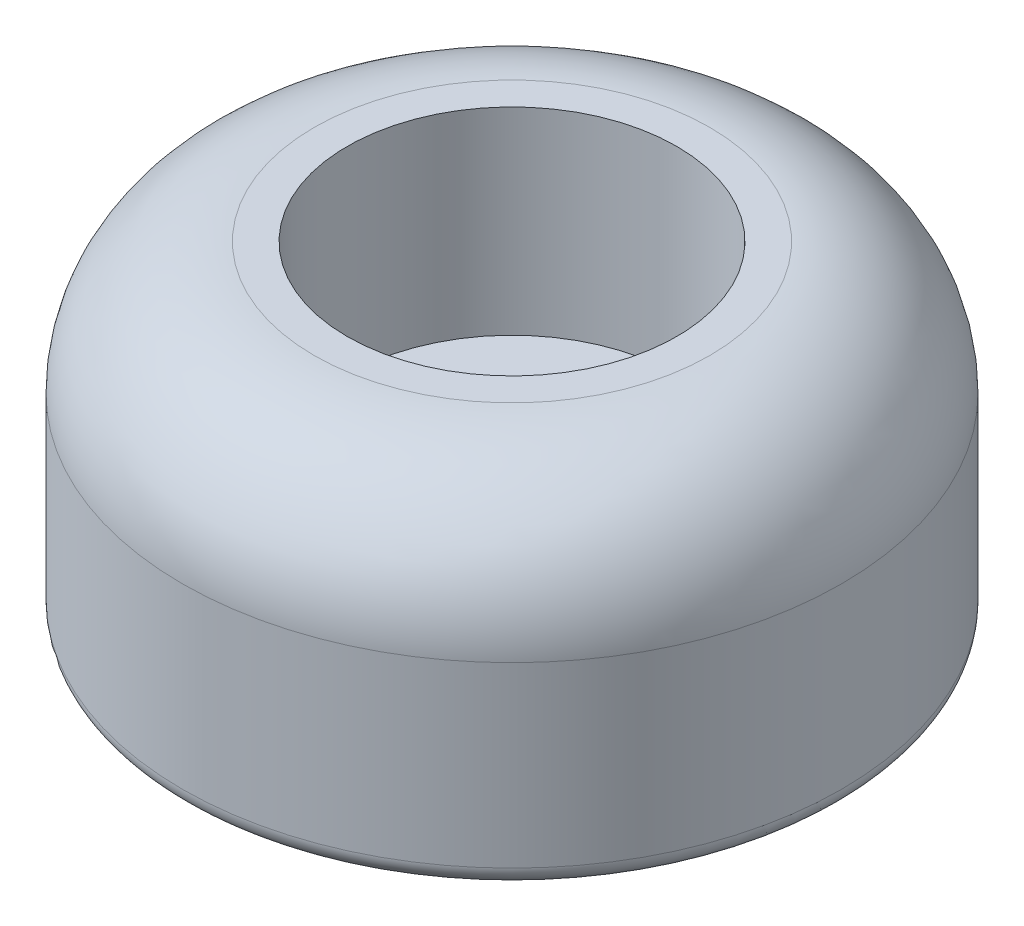
ISO-10303-21;
HEADER;
FILE_DESCRIPTION(('STEP AP214'),'2;1');
FILE_NAME('part.step','',(''),(''),'','','');
FILE_SCHEMA(('AUTOMOTIVE_DESIGN { 1 0 10303 214 1 1 1 1 }'));
ENDSEC;
DATA;
#1=APPLICATION_CONTEXT('core data for automotive mechanical design processes');
#2=APPLICATION_PROTOCOL_DEFINITION('international standard','automotive_design',2000,#1);
#3=PRODUCT_CONTEXT('',#1,'mechanical');
#4=PRODUCT('Part','Part','',(#3));
#5=PRODUCT_RELATED_PRODUCT_CATEGORY('part','',(#4));
#6=PRODUCT_DEFINITION_FORMATION('','',#4);
#7=PRODUCT_DEFINITION_CONTEXT('part definition',#1,'design');
#8=PRODUCT_DEFINITION('design','',#6,#7);
#9=PRODUCT_DEFINITION_SHAPE('','',#8);
#10=(LENGTH_UNIT() NAMED_UNIT(*) SI_UNIT(.MILLI.,.METRE.));
#11=(NAMED_UNIT(*) PLANE_ANGLE_UNIT() SI_UNIT($,.RADIAN.));
#12=(NAMED_UNIT(*) SI_UNIT($,.STERADIAN.) SOLID_ANGLE_UNIT());
#13=UNCERTAINTY_MEASURE_WITH_UNIT(LENGTH_MEASURE(1.E-05),#10,'distance_accuracy_value','');
#14=(GEOMETRIC_REPRESENTATION_CONTEXT(3) GLOBAL_UNCERTAINTY_ASSIGNED_CONTEXT((#13)) GLOBAL_UNIT_ASSIGNED_CONTEXT((#10,
#11,#12)) REPRESENTATION_CONTEXT('',''));
#15=CARTESIAN_POINT('',(0.,0.,0.));
#16=DIRECTION('',(0.,0.,1.));
#17=DIRECTION('',(1.,0.,0.));
#18=AXIS2_PLACEMENT_3D('',#15,#16,#17);
#19=CARTESIAN_POINT('',(2.5,2.,0.));
#20=DIRECTION('',(0.,-1.,0.));
#21=DIRECTION('',(0.,0.,-1.));
#22=AXIS2_PLACEMENT_3D('',#19,#20,#21);
#23=PLANE('',#22);
#24=CARTESIAN_POINT('',(0.,2.,0.));
#25=DIRECTION('',(0.,1.,0.));
#26=DIRECTION('',(0.,0.,1.));
#27=AXIS2_PLACEMENT_3D('',#24,#25,#26);
#28=CIRCLE('',#27,2.5);
#29=CARTESIAN_POINT('',(0.,2.,2.5));
#30=VERTEX_POINT('',#29);
#31=EDGE_CURVE('P0_E66',#30,#30,#28,.T.);
#32=ORIENTED_EDGE('',*,*,#31,.T.);
#33=EDGE_LOOP('',(#32));
#34=FACE_BOUND('',#33,.T.);
#35=CARTESIAN_POINT('',(0.,2.,0.));
#36=DIRECTION('',(0.,1.,0.));
#37=DIRECTION('',(0.,0.,1.));
#38=AXIS2_PLACEMENT_3D('',#35,#36,#37);
#39=CIRCLE('',#38,3.5);
#40=CARTESIAN_POINT('',(0.,2.,3.5));
#41=VERTEX_POINT('',#40);
#42=EDGE_CURVE('P0_E63',#41,#41,#39,.F.);
#43=ORIENTED_EDGE('',*,*,#42,.T.);
#44=EDGE_LOOP('',(#43));
#45=FACE_BOUND('',#44,.T.);
#46=ADVANCED_FACE('P0_F43',(#34,#45),#23,.T.);
#47=CARTESIAN_POINT('',(0.,0.,0.));
#48=DIRECTION('',(0.,1.,0.));
#49=DIRECTION('',(0.,0.,1.));
#50=AXIS2_PLACEMENT_3D('',#47,#48,#49);
#51=CYLINDRICAL_SURFACE('',#50,3.5);
#52=ORIENTED_EDGE('',*,*,#42,.F.);
#53=EDGE_LOOP('',(#52));
#54=FACE_BOUND('',#53,.T.);
#55=CARTESIAN_POINT('',(0.,1.5,0.));
#56=DIRECTION('',(0.,1.,0.));
#57=DIRECTION('',(0.,0.,1.));
#58=AXIS2_PLACEMENT_3D('',#55,#56,#57);
#59=CIRCLE('',#58,3.5);
#60=CARTESIAN_POINT('',(0.,1.5,3.5));
#61=VERTEX_POINT('',#60);
#62=EDGE_CURVE('P0_E71',#61,#61,#59,.T.);
#63=ORIENTED_EDGE('',*,*,#62,.F.);
#64=EDGE_LOOP('',(#63));
#65=FACE_BOUND('',#64,.T.);
#66=ADVANCED_FACE('P0_F137',(#54,#65),#51,.F.);
#67=CARTESIAN_POINT('',(0.,0.,0.));
#68=DIRECTION('',(0.,1.,0.));
#69=DIRECTION('',(0.,0.,1.));
#70=AXIS2_PLACEMENT_3D('',#67,#68,#69);
#71=CYLINDRICAL_SURFACE('',#70,2.5);
#72=CARTESIAN_POINT('',(0.,5.,0.));
#73=DIRECTION('',(0.,1.,0.));
#74=DIRECTION('',(0.,0.,1.));
#75=AXIS2_PLACEMENT_3D('',#72,#73,#74);
#76=CIRCLE('',#75,2.5);
#77=CARTESIAN_POINT('',(0.,5.,2.5));
#78=VERTEX_POINT('',#77);
#79=EDGE_CURVE('P0_E76',#78,#78,#76,.F.);
#80=ORIENTED_EDGE('',*,*,#79,.F.);
#81=EDGE_LOOP('',(#80));
#82=FACE_BOUND('',#81,.T.);
#83=ORIENTED_EDGE('',*,*,#31,.F.);
#84=EDGE_LOOP('',(#83));
#85=FACE_BOUND('',#84,.T.);
#86=ADVANCED_FACE('P0_F133',(#82,#85),#71,.F.);
#87=CARTESIAN_POINT('',(3.5,1.5,0.));
#88=DIRECTION('',(0.,1.,0.));
#89=DIRECTION('',(0.,0.,1.));
#90=AXIS2_PLACEMENT_3D('',#87,#88,#89);
#91=PLANE('',#90);
#92=ORIENTED_EDGE('',*,*,#62,.T.);
#93=EDGE_LOOP('',(#92));
#94=FACE_BOUND('',#93,.T.);
#95=CARTESIAN_POINT('',(0.,1.5,0.));
#96=DIRECTION('',(0.,1.,0.));
#97=DIRECTION('',(0.,0.,1.));
#98=AXIS2_PLACEMENT_3D('',#95,#96,#97);
#99=CIRCLE('',#98,1.5);
#100=CARTESIAN_POINT('',(0.,1.5,1.5));
#101=VERTEX_POINT('',#100);
#102=EDGE_CURVE('P0_E81',#101,#101,#99,.F.);
#103=ORIENTED_EDGE('',*,*,#102,.T.);
#104=EDGE_LOOP('',(#103));
#105=FACE_BOUND('',#104,.T.);
#106=ADVANCED_FACE('P0_F130',(#94,#105),#91,.T.);
#107=CARTESIAN_POINT('',(3.,5.,0.));
#108=DIRECTION('',(0.,1.,0.));
#109=DIRECTION('',(0.,0.,1.));
#110=AXIS2_PLACEMENT_3D('',#107,#108,#109);
#111=PLANE('',#110);
#112=CARTESIAN_POINT('',(0.,5.,0.));
#113=DIRECTION('',(0.,-1.,0.));
#114=DIRECTION('',(0.,0.,-1.));
#115=AXIS2_PLACEMENT_3D('',#112,#113,#114);
#116=CIRCLE('',#115,3.);
#117=CARTESIAN_POINT('',(0.,5.,-3.));
#118=VERTEX_POINT('',#117);
#119=EDGE_CURVE('P0_E86',#118,#118,#116,.T.);
#120=ORIENTED_EDGE('',*,*,#119,.F.);
#121=EDGE_LOOP('',(#120));
#122=FACE_BOUND('',#121,.T.);
#123=ORIENTED_EDGE('',*,*,#79,.T.);
#124=EDGE_LOOP('',(#123));
#125=FACE_BOUND('',#124,.T.);
#126=ADVANCED_FACE('P0_F121',(#122,#125),#111,.T.);
#127=CARTESIAN_POINT('',(0.,0.,0.));
#128=DIRECTION('',(0.,1.,0.));
#129=DIRECTION('',(0.,0.,1.));
#130=AXIS2_PLACEMENT_3D('',#127,#128,#129);
#131=CYLINDRICAL_SURFACE('',#130,1.5);
#132=ORIENTED_EDGE('',*,*,#102,.F.);
#133=EDGE_LOOP('',(#132));
#134=FACE_BOUND('',#133,.T.);
#135=CARTESIAN_POINT('',(0.,0.,0.));
#136=DIRECTION('',(0.,1.,0.));
#137=DIRECTION('',(0.,0.,1.));
#138=AXIS2_PLACEMENT_3D('',#135,#136,#137);
#139=CIRCLE('',#138,1.5);
#140=CARTESIAN_POINT('',(0.,0.,1.5));
#141=VERTEX_POINT('',#140);
#142=EDGE_CURVE('P0_E58',#141,#141,#139,.T.);
#143=ORIENTED_EDGE('',*,*,#142,.F.);
#144=EDGE_LOOP('',(#143));
#145=FACE_BOUND('',#144,.T.);
#146=ADVANCED_FACE('P0_F109',(#134,#145),#131,.F.);
#147=CARTESIAN_POINT('',(0.,3.,0.));
#148=DIRECTION('',(0.,-1.,0.));
#149=DIRECTION('',(0.,0.,-1.));
#150=AXIS2_PLACEMENT_3D('',#147,#148,#149);
#151=TOROIDAL_SURFACE('',#150,3.,2.);
#152=CARTESIAN_POINT('',(0.,3.,0.));
#153=DIRECTION('',(0.,1.,0.));
#154=DIRECTION('',(0.,0.,1.));
#155=AXIS2_PLACEMENT_3D('',#152,#153,#154);
#156=CIRCLE('',#155,5.);
#157=CARTESIAN_POINT('',(0.,3.,5.));
#158=VERTEX_POINT('',#157);
#159=EDGE_CURVE('P0_E54',#158,#158,#156,.F.);
#160=ORIENTED_EDGE('',*,*,#159,.F.);
#161=EDGE_LOOP('',(#160));
#162=FACE_BOUND('',#161,.T.);
#163=ORIENTED_EDGE('',*,*,#119,.T.);
#164=EDGE_LOOP('',(#163));
#165=FACE_BOUND('',#164,.T.);
#166=ADVANCED_FACE('P0_F97',(#162,#165),#151,.T.);
#167=CARTESIAN_POINT('',(1.5,0.,0.));
#168=DIRECTION('',(0.,-1.,0.));
#169=DIRECTION('',(0.,0.,-1.));
#170=AXIS2_PLACEMENT_3D('',#167,#168,#169);
#171=PLANE('',#170);
#172=CARTESIAN_POINT('',(0.,0.,0.));
#173=DIRECTION('',(0.,-1.,0.));
#174=DIRECTION('',(0.,0.,-1.));
#175=AXIS2_PLACEMENT_3D('',#172,#173,#174);
#176=CIRCLE('',#175,4.7);
#177=CARTESIAN_POINT('',(0.,0.,-4.7));
#178=VERTEX_POINT('',#177);
#179=EDGE_CURVE('P0_E10',#178,#178,#176,.T.);
#180=ORIENTED_EDGE('',*,*,#179,.T.);
#181=EDGE_LOOP('',(#180));
#182=FACE_BOUND('',#181,.T.);
#183=ORIENTED_EDGE('',*,*,#142,.T.);
#184=EDGE_LOOP('',(#183));
#185=FACE_BOUND('',#184,.T.);
#186=ADVANCED_FACE('P0_F108',(#182,#185),#171,.T.);
#187=CARTESIAN_POINT('',(0.,0.,0.));
#188=DIRECTION('',(0.,1.,0.));
#189=DIRECTION('',(0.,0.,1.));
#190=AXIS2_PLACEMENT_3D('',#187,#188,#189);
#191=CYLINDRICAL_SURFACE('',#190,5.);
#192=CARTESIAN_POINT('',(0.,0.3,0.));
#193=DIRECTION('',(0.,-1.,0.));
#194=DIRECTION('',(0.,0.,-1.));
#195=AXIS2_PLACEMENT_3D('',#192,#193,#194);
#196=CIRCLE('',#195,5.);
#197=CARTESIAN_POINT('',(0.,0.3,-5.));
#198=VERTEX_POINT('',#197);
#199=EDGE_CURVE('P0_E50',#198,#198,#196,.F.);
#200=ORIENTED_EDGE('',*,*,#199,.T.);
#201=EDGE_LOOP('',(#200));
#202=FACE_BOUND('',#201,.T.);
#203=ORIENTED_EDGE('',*,*,#159,.T.);
#204=EDGE_LOOP('',(#203));
#205=FACE_BOUND('',#204,.T.);
#206=ADVANCED_FACE('P0_F147',(#202,#205),#191,.T.);
#207=CARTESIAN_POINT('',(0.,0.3,0.));
#208=DIRECTION('',(0.,-1.,0.));
#209=DIRECTION('',(0.,0.,-1.));
#210=AXIS2_PLACEMENT_3D('',#207,#208,#209);
#211=TOROIDAL_SURFACE('',#210,4.7,0.3);
#212=ORIENTED_EDGE('',*,*,#179,.F.);
#213=EDGE_LOOP('',(#212));
#214=FACE_BOUND('',#213,.T.);
#215=ORIENTED_EDGE('',*,*,#199,.F.);
#216=EDGE_LOOP('',(#215));
#217=FACE_BOUND('',#216,.T.);
#218=ADVANCED_FACE('P0_F45',(#214,#217),#211,.T.);
#219=CLOSED_SHELL('',(#46,#66,#86,#106,#126,#146,#166,#186,#206,#218));
#220=MANIFOLD_SOLID_BREP('P0_B2',#219);
#221=CARTESIAN_POINT('',(1.5,2.,0.));
#222=DIRECTION('',(0.,1.,0.));
#223=DIRECTION('',(0.,0.,1.));
#224=AXIS2_PLACEMENT_3D('',#221,#222,#223);
#225=PLANE('',#224);
#226=CARTESIAN_POINT('',(0.,2.,0.));
#227=DIRECTION('',(0.,-1.,0.));
#228=DIRECTION('',(0.,0.,-1.));
#229=AXIS2_PLACEMENT_3D('',#226,#227,#228);
#230=CIRCLE('',#229,1.5);
#231=CARTESIAN_POINT('',(0.,2.,-1.5));
#232=VERTEX_POINT('',#231);
#233=EDGE_CURVE('P1_E36',#232,#232,#230,.T.);
#234=ORIENTED_EDGE('',*,*,#233,.T.);
#235=EDGE_LOOP('',(#234));
#236=FACE_BOUND('',#235,.T.);
#237=CARTESIAN_POINT('',(0.,2.,0.));
#238=DIRECTION('',(0.,-1.,0.));
#239=DIRECTION('',(0.,0.,-1.));
#240=AXIS2_PLACEMENT_3D('',#237,#238,#239);
#241=CIRCLE('',#240,3.5);
#242=CARTESIAN_POINT('',(0.,2.,-3.5));
#243=VERTEX_POINT('',#242);
#244=EDGE_CURVE('P1_E27',#243,#243,#241,.T.);
#245=ORIENTED_EDGE('',*,*,#244,.F.);
#246=EDGE_LOOP('',(#245));
#247=FACE_BOUND('',#246,.T.);
#248=ADVANCED_FACE('P1_F15',(#236,#247),#225,.T.);
#249=CARTESIAN_POINT('',(0.,2.,0.));
#250=DIRECTION('',(0.,-1.,0.));
#251=DIRECTION('',(0.,0.,-1.));
#252=AXIS2_PLACEMENT_3D('',#249,#250,#251);
#253=CYLINDRICAL_SURFACE('',#252,1.5);
#254=CARTESIAN_POINT('',(0.,1.5,0.));
#255=DIRECTION('',(0.,-1.,0.));
#256=DIRECTION('',(0.,0.,-1.));
#257=AXIS2_PLACEMENT_3D('',#254,#255,#256);
#258=CIRCLE('',#257,1.5);
#259=CARTESIAN_POINT('',(0.,1.5,-1.5));
#260=VERTEX_POINT('',#259);
#261=EDGE_CURVE('P1_E22',#260,#260,#258,.F.);
#262=ORIENTED_EDGE('',*,*,#261,.F.);
#263=EDGE_LOOP('',(#262));
#264=FACE_BOUND('',#263,.T.);
#265=ORIENTED_EDGE('',*,*,#233,.F.);
#266=EDGE_LOOP('',(#265));
#267=FACE_BOUND('',#266,.T.);
#268=ADVANCED_FACE('P1_F43',(#264,#267),#253,.F.);
#269=CARTESIAN_POINT('',(0.,2.,0.));
#270=DIRECTION('',(0.,-1.,0.));
#271=DIRECTION('',(0.,0.,-1.));
#272=AXIS2_PLACEMENT_3D('',#269,#270,#271);
#273=CYLINDRICAL_SURFACE('',#272,3.5);
#274=ORIENTED_EDGE('',*,*,#244,.T.);
#275=EDGE_LOOP('',(#274));
#276=FACE_BOUND('',#275,.T.);
#277=CARTESIAN_POINT('',(0.,1.5,0.));
#278=DIRECTION('',(0.,-1.,0.));
#279=DIRECTION('',(0.,0.,-1.));
#280=AXIS2_PLACEMENT_3D('',#277,#278,#279);
#281=CIRCLE('',#280,3.5);
#282=CARTESIAN_POINT('',(0.,1.5,-3.5));
#283=VERTEX_POINT('',#282);
#284=EDGE_CURVE('P1_E10',#283,#283,#281,.T.);
#285=ORIENTED_EDGE('',*,*,#284,.F.);
#286=EDGE_LOOP('',(#285));
#287=FACE_BOUND('',#286,.T.);
#288=ADVANCED_FACE('P1_F45',(#276,#287),#273,.T.);
#289=CARTESIAN_POINT('',(3.5,1.5,0.));
#290=DIRECTION('',(0.,-1.,0.));
#291=DIRECTION('',(0.,0.,-1.));
#292=AXIS2_PLACEMENT_3D('',#289,#290,#291);
#293=PLANE('',#292);
#294=ORIENTED_EDGE('',*,*,#284,.T.);
#295=EDGE_LOOP('',(#294));
#296=FACE_BOUND('',#295,.T.);
#297=ORIENTED_EDGE('',*,*,#261,.T.);
#298=EDGE_LOOP('',(#297));
#299=FACE_BOUND('',#298,.T.);
#300=ADVANCED_FACE('P1_F52',(#296,#299),#293,.T.);
#301=CLOSED_SHELL('',(#248,#268,#288,#300));
#302=MANIFOLD_SOLID_BREP('P1_B1',#301);
#303=ADVANCED_BREP_SHAPE_REPRESENTATION('',(#18,#220,#302),#14);
#304=SHAPE_DEFINITION_REPRESENTATION(#9,#303);
ENDSEC;
END-ISO-10303-21;
